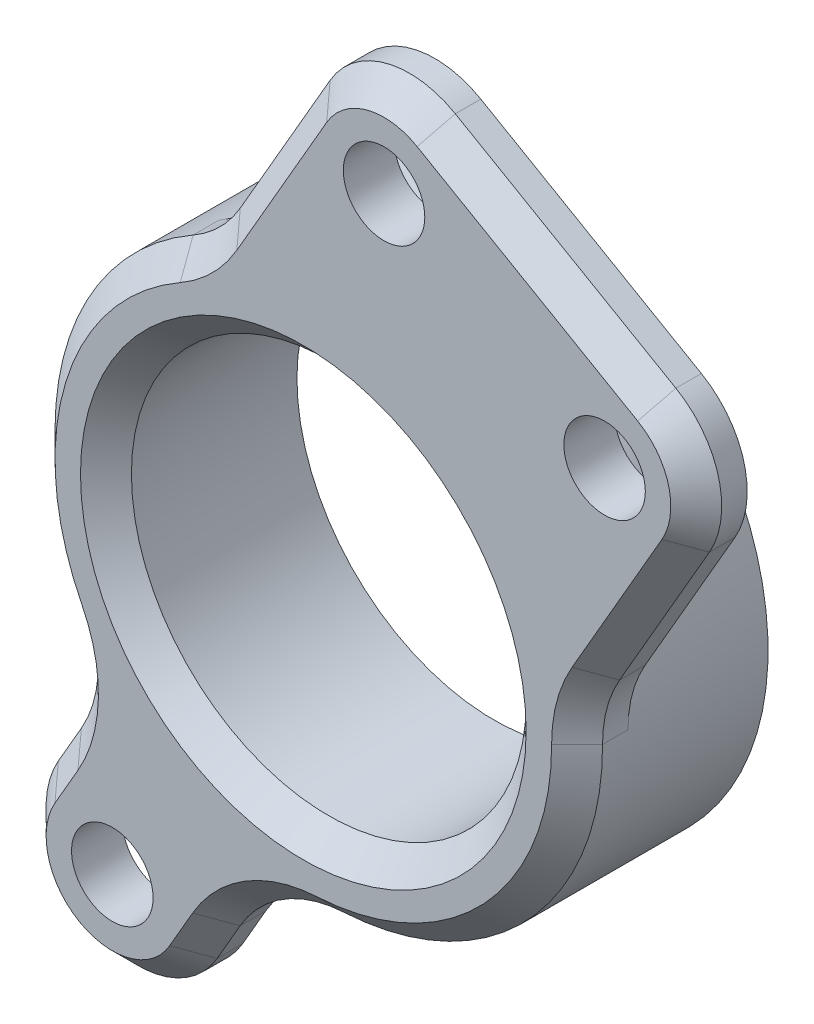
ISO-10303-21;
HEADER;
FILE_DESCRIPTION(('STEP AP214'),'2;1');
FILE_NAME('part.step','',(''),(''),'','','');
FILE_SCHEMA(('AUTOMOTIVE_DESIGN { 1 0 10303 214 1 1 1 1 }'));
ENDSEC;
DATA;
#1=APPLICATION_CONTEXT('core data for automotive mechanical design processes');
#2=APPLICATION_PROTOCOL_DEFINITION('international standard','automotive_design',2000,#1);
#3=PRODUCT_CONTEXT('',#1,'mechanical');
#4=PRODUCT('Part','Part','',(#3));
#5=PRODUCT_RELATED_PRODUCT_CATEGORY('part','',(#4));
#6=PRODUCT_DEFINITION_FORMATION('','',#4);
#7=PRODUCT_DEFINITION_CONTEXT('part definition',#1,'design');
#8=PRODUCT_DEFINITION('design','',#6,#7);
#9=PRODUCT_DEFINITION_SHAPE('','',#8);
#10=(LENGTH_UNIT() NAMED_UNIT(*) SI_UNIT(.MILLI.,.METRE.));
#11=(NAMED_UNIT(*) PLANE_ANGLE_UNIT() SI_UNIT($,.RADIAN.));
#12=(NAMED_UNIT(*) SI_UNIT($,.STERADIAN.) SOLID_ANGLE_UNIT());
#13=UNCERTAINTY_MEASURE_WITH_UNIT(LENGTH_MEASURE(1.E-05),#10,'distance_accuracy_value','');
#14=(GEOMETRIC_REPRESENTATION_CONTEXT(3) GLOBAL_UNCERTAINTY_ASSIGNED_CONTEXT((#13)) GLOBAL_UNIT_ASSIGNED_CONTEXT((#10,
#11,#12)) REPRESENTATION_CONTEXT('',''));
#15=CARTESIAN_POINT('',(0.,0.,0.));
#16=DIRECTION('',(0.,0.,1.));
#17=DIRECTION('',(1.,0.,0.));
#18=AXIS2_PLACEMENT_3D('',#15,#16,#17);
#19=CARTESIAN_POINT('',(0.,0.,0.));
#20=DIRECTION('',(0.,0.,1.));
#21=DIRECTION('',(1.,0.,0.));
#22=AXIS2_PLACEMENT_3D('',#19,#20,#21);
#23=PLANE('',#22);
#24=CARTESIAN_POINT('',(3.16987298107781,15.4903810567665,0.));
#25=DIRECTION('',(0.,0.,1.));
#26=DIRECTION('',(1.,0.,0.));
#27=AXIS2_PLACEMENT_3D('',#24,#25,#26);
#28=CIRCLE('',#27,1.6);
#29=CARTESIAN_POINT('',(4.76987298107781,15.4903810567665,0.));
#30=VERTEX_POINT('',#29);
#31=EDGE_CURVE('E245',#30,#30,#28,.T.);
#32=ORIENTED_EDGE('',*,*,#31,.T.);
#33=EDGE_LOOP('',(#32));
#34=FACE_BOUND('',#33,.T.);
#35=CARTESIAN_POINT('',(11.8301270189222,10.4903810567665,0.));
#36=DIRECTION('',(0.,0.,1.));
#37=DIRECTION('',(1.,0.,0.));
#38=AXIS2_PLACEMENT_3D('',#35,#36,#37);
#39=CIRCLE('',#38,1.6);
#40=CARTESIAN_POINT('',(13.4301270189222,10.4903810567665,0.));
#41=VERTEX_POINT('',#40);
#42=EDGE_CURVE('E242',#41,#41,#39,.T.);
#43=ORIENTED_EDGE('',*,*,#42,.T.);
#44=EDGE_LOOP('',(#43));
#45=FACE_BOUND('',#44,.T.);
#46=DIRECTION('',(-0.500000000000001,-0.866025403784438,0.));
#47=VECTOR('',#46,1.);
#48=CARTESIAN_POINT('',(7.44781847254616,-4.3,0.));
#49=LINE('',#48,#47);
#50=CARTESIAN_POINT('',(14.9478184725461,8.69038105676655,0.));
#51=VERTEX_POINT('',#50);
#52=CARTESIAN_POINT('',(11.4196725735927,2.57945310326333,0.));
#53=VERTEX_POINT('',#52);
#54=EDGE_CURVE('E227',#51,#53,#49,.T.);
#55=ORIENTED_EDGE('',*,*,#54,.T.);
#56=CARTESIAN_POINT('',(15.7497995925148,0.0794531032633251,0.));
#57=DIRECTION('',(0.,0.,1.));
#58=DIRECTION('',(1.,0.,0.));
#59=AXIS2_PLACEMENT_3D('',#56,#57,#58);
#60=CIRCLE('',#59,5.);
#61=CARTESIAN_POINT('',(10.7498632139387,0.0542298958781293,0.));
#62=VERTEX_POINT('',#61);
#63=EDGE_CURVE('E284',#53,#62,#60,.T.);
#64=ORIENTED_EDGE('',*,*,#63,.T.);
#65=CARTESIAN_POINT('',(0.,0.,0.));
#66=DIRECTION('',(0.,0.,1.));
#67=DIRECTION('',(1.,0.,0.));
#68=AXIS2_PLACEMENT_3D('',#65,#66,#67);
#69=CIRCLE('',#68,10.75);
#70=CARTESIAN_POINT('',(-5.3279671394943,9.33676957841782,0.));
#71=VERTEX_POINT('',#70);
#72=EDGE_CURVE('E390',#62,#71,#69,.T.);
#73=ORIENTED_EDGE('',*,*,#72,.T.);
#74=CARTESIAN_POINT('',(-7.80609139042187,13.6794531032633,0.));
#75=DIRECTION('',(0.,0.,1.));
#76=DIRECTION('',(1.,0.,0.));
#77=AXIS2_PLACEMENT_3D('',#74,#75,#76);
#78=CIRCLE('',#77,5.);
#79=CARTESIAN_POINT('',(-3.47596437149967,11.1794531032633,0.));
#80=VERTEX_POINT('',#79);
#81=EDGE_CURVE('E278',#71,#80,#78,.T.);
#82=ORIENTED_EDGE('',*,*,#81,.T.);
#83=DIRECTION('',(-0.500000000000001,-0.866025403784438,0.));
#84=VECTOR('',#83,1.);
#85=CARTESIAN_POINT('',(-7.44781847254617,4.3,0.));
#86=LINE('',#85,#84);
#87=CARTESIAN_POINT('',(0.0521815274538246,17.2903810567665,0.));
#88=VERTEX_POINT('',#87);
#89=EDGE_CURVE('E239',#88,#80,#86,.T.);
#90=ORIENTED_EDGE('',*,*,#89,.F.);
#91=CARTESIAN_POINT('',(3.16987298107781,15.4903810567665,0.));
#92=DIRECTION('',(0.,0.,1.));
#93=DIRECTION('',(1.,0.,0.));
#94=AXIS2_PLACEMENT_3D('',#91,#92,#93);
#95=CIRCLE('',#94,3.6);
#96=CARTESIAN_POINT('',(4.96987298107781,18.6080725103905,0.));
#97=VERTEX_POINT('',#96);
#98=EDGE_CURVE('E236',#97,#88,#95,.T.);
#99=ORIENTED_EDGE('',*,*,#98,.F.);
#100=DIRECTION('',(0.866025403784438,-0.500000000000001,0.));
#101=VECTOR('',#100,1.);
#102=CARTESIAN_POINT('',(9.29999999999999,16.1080725103905,0.));
#103=LINE('',#102,#101);
#104=CARTESIAN_POINT('',(13.6301270189222,13.6080725103905,0.));
#105=VERTEX_POINT('',#104);
#106=EDGE_CURVE('E233',#97,#105,#103,.T.);
#107=ORIENTED_EDGE('',*,*,#106,.T.);
#108=CARTESIAN_POINT('',(11.8301270189222,10.4903810567665,0.));
#109=DIRECTION('',(0.,0.,1.));
#110=DIRECTION('',(1.,0.,0.));
#111=AXIS2_PLACEMENT_3D('',#108,#109,#110);
#112=CIRCLE('',#111,3.6);
#113=EDGE_CURVE('E230',#105,#51,#112,.F.);
#114=ORIENTED_EDGE('',*,*,#113,.T.);
#115=EDGE_LOOP('',(#55,#64,#73,#82,#90,#99,#107,#114));
#116=FACE_BOUND('',#115,.T.);
#117=ADVANCED_FACE('F48',(#34,#45,#116),#23,.F.);
#118=CARTESIAN_POINT('',(-3.11769145362399,1.80000000000001,2.));
#119=DIRECTION('',(-0.866025403784439,0.5,0.));
#120=DIRECTION('',(-0.5,-0.866025403784439,0.));
#121=AXIS2_PLACEMENT_3D('',#118,#119,#120);
#122=PLANE('',#121);
#123=DIRECTION('',(0.,0.,-1.));
#124=VECTOR('',#123,1.);
#125=CARTESIAN_POINT('',(-10.617691453624,-11.1903810567666,2.));
#126=LINE('',#125,#124);
#127=CARTESIAN_POINT('',(-10.617691453624,-11.1903810567666,0.999999999999991));
#128=VERTEX_POINT('',#127);
#129=CARTESIAN_POINT('',(-10.617691453624,-11.1903810567666,0.));
#130=VERTEX_POINT('',#129);
#131=EDGE_CURVE('E194',#128,#130,#126,.T.);
#132=ORIENTED_EDGE('',*,*,#131,.F.);
#133=DIRECTION('',(0.5,0.866025403784439,0.));
#134=VECTOR('',#133,1.);
#135=CARTESIAN_POINT('',(-3.11769145362399,1.80000000000001,0.999999999999991));
#136=LINE('',#135,#134);
#137=CARTESIAN_POINT('',(-9.71508677299059,-9.62702389076004,0.999999999999992));
#138=VERTEX_POINT('',#137);
#139=EDGE_CURVE('E323',#128,#138,#136,.T.);
#140=ORIENTED_EDGE('',*,*,#139,.T.);
#141=DIRECTION('',(0.,0.,-1.));
#142=VECTOR('',#141,1.);
#143=CARTESIAN_POINT('',(-9.71508677299059,-9.62702389076004,2.));
#144=LINE('',#143,#142);
#145=CARTESIAN_POINT('',(-9.71508677299059,-9.62702389076004,0.));
#146=VERTEX_POINT('',#145);
#147=EDGE_CURVE('E217',#138,#146,#144,.T.);
#148=ORIENTED_EDGE('',*,*,#147,.T.);
#149=DIRECTION('',(0.5,0.866025403784439,0.));
#150=VECTOR('',#149,1.);
#151=CARTESIAN_POINT('',(-3.11769145362399,1.80000000000001,0.));
#152=LINE('',#151,#150);
#153=EDGE_CURVE('E211',#130,#146,#152,.T.);
#154=ORIENTED_EDGE('',*,*,#153,.F.);
#155=EDGE_LOOP('',(#132,#140,#148,#154));
#156=FACE_BOUND('',#155,.T.);
#157=ADVANCED_FACE('F215',(#156),#122,.T.);
#158=CARTESIAN_POINT('',(-7.50000000000003,-12.9903810567666,2.));
#159=DIRECTION('',(0.,0.,-1.));
#160=DIRECTION('',(-1.,0.,0.));
#161=AXIS2_PLACEMENT_3D('',#158,#159,#160);
#162=CYLINDRICAL_SURFACE('',#161,3.6);
#163=DIRECTION('',(0.,0.,-1.));
#164=VECTOR('',#163,1.);
#165=CARTESIAN_POINT('',(-4.38230854637605,-14.7903810567666,2.));
#166=LINE('',#165,#164);
#167=CARTESIAN_POINT('',(-4.38230854637605,-14.7903810567666,0.999999999999992));
#168=VERTEX_POINT('',#167);
#169=CARTESIAN_POINT('',(-4.38230854637605,-14.7903810567666,0.));
#170=VERTEX_POINT('',#169);
#171=EDGE_CURVE('E204',#168,#170,#166,.T.);
#172=ORIENTED_EDGE('',*,*,#171,.F.);
#173=CARTESIAN_POINT('',(-7.50000000000003,-12.9903810567666,0.999999999999992));
#174=DIRECTION('',(0.,0.,1.));
#175=DIRECTION('',(1.,0.,0.));
#176=AXIS2_PLACEMENT_3D('',#173,#174,#175);
#177=CIRCLE('',#176,3.6);
#178=EDGE_CURVE('E200',#168,#128,#177,.F.);
#179=ORIENTED_EDGE('',*,*,#178,.T.);
#180=ORIENTED_EDGE('',*,*,#131,.T.);
#181=CARTESIAN_POINT('',(-7.50000000000003,-12.9903810567666,0.));
#182=DIRECTION('',(0.,0.,1.));
#183=DIRECTION('',(1.,0.,0.));
#184=AXIS2_PLACEMENT_3D('',#181,#182,#183);
#185=CIRCLE('',#184,3.6);
#186=EDGE_CURVE('E198',#130,#170,#185,.T.);
#187=ORIENTED_EDGE('',*,*,#186,.T.);
#188=EDGE_LOOP('',(#172,#179,#180,#187));
#189=FACE_BOUND('',#188,.T.);
#190=ADVANCED_FACE('F197',(#189),#162,.T.);
#191=CARTESIAN_POINT('',(3.11769145362398,-1.8,2.));
#192=DIRECTION('',(-0.866025403784438,0.5,0.));
#193=DIRECTION('',(-0.5,-0.866025403784438,0.));
#194=AXIS2_PLACEMENT_3D('',#191,#192,#193);
#195=PLANE('',#194);
#196=DIRECTION('',(0.,0.,1.));
#197=VECTOR('',#196,1.);
#198=CARTESIAN_POINT('',(-3.47970386574262,-13.22702389076,2.));
#199=LINE('',#198,#197);
#200=CARTESIAN_POINT('',(-3.47970386574262,-13.22702389076,0.));
#201=VERTEX_POINT('',#200);
#202=CARTESIAN_POINT('',(-3.47970386574262,-13.22702389076,0.999999999999992));
#203=VERTEX_POINT('',#202);
#204=EDGE_CURVE('E273',#201,#203,#199,.T.);
#205=ORIENTED_EDGE('',*,*,#204,.T.);
#206=DIRECTION('',(-0.5,-0.866025403784438,0.));
#207=VECTOR('',#206,1.);
#208=CARTESIAN_POINT('',(-4.38230854637605,-14.7903810567666,0.999999999999992));
#209=LINE('',#208,#207);
#210=EDGE_CURVE('E325',#203,#168,#209,.T.);
#211=ORIENTED_EDGE('',*,*,#210,.T.);
#212=ORIENTED_EDGE('',*,*,#171,.T.);
#213=DIRECTION('',(0.5,0.866025403784438,0.));
#214=VECTOR('',#213,1.);
#215=CARTESIAN_POINT('',(3.11769145362398,-1.8,0.));
#216=LINE('',#215,#214);
#217=EDGE_CURVE('E213',#170,#201,#216,.T.);
#218=ORIENTED_EDGE('',*,*,#217,.T.);
#219=EDGE_LOOP('',(#205,#211,#212,#218));
#220=FACE_BOUND('',#219,.T.);
#221=ADVANCED_FACE('F462',(#220),#195,.F.);
#222=CARTESIAN_POINT('',(7.44781847254616,-4.3,2.));
#223=DIRECTION('',(0.866025403784438,-0.500000000000001,0.));
#224=DIRECTION('',(0.500000000000001,0.866025403784438,0.));
#225=AXIS2_PLACEMENT_3D('',#222,#223,#224);
#226=PLANE('',#225);
#227=DIRECTION('',(0.,0.,-1.));
#228=VECTOR('',#227,1.);
#229=CARTESIAN_POINT('',(14.9478184725461,8.69038105676655,2.));
#230=LINE('',#229,#228);
#231=CARTESIAN_POINT('',(14.9478184725461,8.69038105676655,0.999999999999992));
#232=VERTEX_POINT('',#231);
#233=EDGE_CURVE('E256',#232,#51,#230,.T.);
#234=ORIENTED_EDGE('',*,*,#233,.F.);
#235=DIRECTION('',(-0.500000000000001,-0.866025403784438,0.));
#236=VECTOR('',#235,1.);
#237=CARTESIAN_POINT('',(7.44781847254616,-4.3,0.999999999999991));
#238=LINE('',#237,#236);
#239=CARTESIAN_POINT('',(11.4196725735927,2.57945310326333,0.999999999999991));
#240=VERTEX_POINT('',#239);
#241=EDGE_CURVE('E341',#232,#240,#238,.T.);
#242=ORIENTED_EDGE('',*,*,#241,.T.);
#243=DIRECTION('',(0.,0.,-1.));
#244=VECTOR('',#243,1.);
#245=CARTESIAN_POINT('',(11.4196725735927,2.57945310326333,2.));
#246=LINE('',#245,#244);
#247=EDGE_CURVE('E276',#240,#53,#246,.T.);
#248=ORIENTED_EDGE('',*,*,#247,.T.);
#249=ORIENTED_EDGE('',*,*,#54,.F.);
#250=EDGE_LOOP('',(#234,#242,#248,#249));
#251=FACE_BOUND('',#250,.T.);
#252=ADVANCED_FACE('F458',(#251),#226,.T.);
#253=CARTESIAN_POINT('',(11.8301270189222,10.4903810567665,2.));
#254=DIRECTION('',(0.,0.,-1.));
#255=DIRECTION('',(-1.,0.,0.));
#256=AXIS2_PLACEMENT_3D('',#253,#254,#255);
#257=CYLINDRICAL_SURFACE('',#256,3.6);
#258=DIRECTION('',(0.,0.,-1.));
#259=VECTOR('',#258,1.);
#260=CARTESIAN_POINT('',(13.6301270189222,13.6080725103905,2.));
#261=LINE('',#260,#259);
#262=CARTESIAN_POINT('',(13.6301270189222,13.6080725103905,0.999999999999992));
#263=VERTEX_POINT('',#262);
#264=EDGE_CURVE('E254',#263,#105,#261,.T.);
#265=ORIENTED_EDGE('',*,*,#264,.F.);
#266=CARTESIAN_POINT('',(11.8301270189222,10.4903810567665,0.999999999999992));
#267=DIRECTION('',(0.,0.,1.));
#268=DIRECTION('',(1.,0.,0.));
#269=AXIS2_PLACEMENT_3D('',#266,#267,#268);
#270=CIRCLE('',#269,3.6);
#271=EDGE_CURVE('E58',#263,#232,#270,.F.);
#272=ORIENTED_EDGE('',*,*,#271,.T.);
#273=ORIENTED_EDGE('',*,*,#233,.T.);
#274=ORIENTED_EDGE('',*,*,#113,.F.);
#275=EDGE_LOOP('',(#265,#272,#273,#274));
#276=FACE_BOUND('',#275,.T.);
#277=ADVANCED_FACE('F455',(#276),#257,.T.);
#278=CARTESIAN_POINT('',(9.29999999999999,16.1080725103905,2.));
#279=DIRECTION('',(0.500000000000001,0.866025403784438,0.));
#280=DIRECTION('',(-0.866025403784438,0.500000000000001,0.));
#281=AXIS2_PLACEMENT_3D('',#278,#279,#280);
#282=PLANE('',#281);
#283=DIRECTION('',(0.,0.,-1.));
#284=VECTOR('',#283,1.);
#285=CARTESIAN_POINT('',(4.96987298107781,18.6080725103905,2.));
#286=LINE('',#285,#284);
#287=CARTESIAN_POINT('',(4.96987298107781,18.6080725103905,0.999999999999992));
#288=VERTEX_POINT('',#287);
#289=EDGE_CURVE('E251',#288,#97,#286,.T.);
#290=ORIENTED_EDGE('',*,*,#289,.F.);
#291=DIRECTION('',(0.866025403784438,-0.500000000000001,0.));
#292=VECTOR('',#291,1.);
#293=CARTESIAN_POINT('',(9.29999999999999,16.1080725103905,0.999999999999992));
#294=LINE('',#293,#292);
#295=EDGE_CURVE('E12',#288,#263,#294,.T.);
#296=ORIENTED_EDGE('',*,*,#295,.T.);
#297=ORIENTED_EDGE('',*,*,#264,.T.);
#298=ORIENTED_EDGE('',*,*,#106,.F.);
#299=EDGE_LOOP('',(#290,#296,#297,#298));
#300=FACE_BOUND('',#299,.T.);
#301=ADVANCED_FACE('F452',(#300),#282,.T.);
#302=CARTESIAN_POINT('',(3.16987298107781,15.4903810567665,2.));
#303=DIRECTION('',(0.,0.,-1.));
#304=DIRECTION('',(-1.,0.,0.));
#305=AXIS2_PLACEMENT_3D('',#302,#303,#304);
#306=CYLINDRICAL_SURFACE('',#305,3.6);
#307=DIRECTION('',(0.,0.,-1.));
#308=VECTOR('',#307,1.);
#309=CARTESIAN_POINT('',(0.0521815274538246,17.2903810567665,2.));
#310=LINE('',#309,#308);
#311=CARTESIAN_POINT('',(0.0521815274538246,17.2903810567665,0.999999999999992));
#312=VERTEX_POINT('',#311);
#313=EDGE_CURVE('E249',#312,#88,#310,.T.);
#314=ORIENTED_EDGE('',*,*,#313,.F.);
#315=CARTESIAN_POINT('',(3.16987298107781,15.4903810567665,0.999999999999992));
#316=DIRECTION('',(0.,0.,1.));
#317=DIRECTION('',(1.,0.,0.));
#318=AXIS2_PLACEMENT_3D('',#315,#316,#317);
#319=CIRCLE('',#318,3.6);
#320=EDGE_CURVE('E72',#312,#288,#319,.F.);
#321=ORIENTED_EDGE('',*,*,#320,.T.);
#322=ORIENTED_EDGE('',*,*,#289,.T.);
#323=ORIENTED_EDGE('',*,*,#98,.T.);
#324=EDGE_LOOP('',(#314,#321,#322,#323));
#325=FACE_BOUND('',#324,.T.);
#326=ADVANCED_FACE('F448',(#325),#306,.T.);
#327=CARTESIAN_POINT('',(-7.44781847254617,4.3,2.));
#328=DIRECTION('',(0.866025403784438,-0.500000000000001,0.));
#329=DIRECTION('',(0.500000000000001,0.866025403784438,0.));
#330=AXIS2_PLACEMENT_3D('',#327,#328,#329);
#331=PLANE('',#330);
#332=DIRECTION('',(0.,0.,1.));
#333=VECTOR('',#332,1.);
#334=CARTESIAN_POINT('',(-3.47596437149967,11.1794531032633,2.));
#335=LINE('',#334,#333);
#336=CARTESIAN_POINT('',(-3.47596437149967,11.1794531032633,0.999999999999994));
#337=VERTEX_POINT('',#336);
#338=EDGE_CURVE('E269',#80,#337,#335,.T.);
#339=ORIENTED_EDGE('',*,*,#338,.T.);
#340=DIRECTION('',(0.500000000000001,0.866025403784438,0.));
#341=VECTOR('',#340,1.);
#342=CARTESIAN_POINT('',(0.0521815274538241,17.2903810567665,0.999999999999994));
#343=LINE('',#342,#341);
#344=EDGE_CURVE('E339',#337,#312,#343,.T.);
#345=ORIENTED_EDGE('',*,*,#344,.T.);
#346=ORIENTED_EDGE('',*,*,#313,.T.);
#347=ORIENTED_EDGE('',*,*,#89,.T.);
#348=EDGE_LOOP('',(#339,#345,#346,#347));
#349=FACE_BOUND('',#348,.T.);
#350=ADVANCED_FACE('F438',(#349),#331,.F.);
#351=CARTESIAN_POINT('',(11.8301270189222,10.4903810567665,2.));
#352=DIRECTION('',(0.,0.,-1.));
#353=DIRECTION('',(-1.,0.,0.));
#354=AXIS2_PLACEMENT_3D('',#351,#352,#353);
#355=CYLINDRICAL_SURFACE('',#354,1.6);
#356=CARTESIAN_POINT('',(11.8301270189222,10.4903810567665,2.));
#357=DIRECTION('',(0.,0.,1.));
#358=DIRECTION('',(1.,0.,0.));
#359=AXIS2_PLACEMENT_3D('',#356,#357,#358);
#360=CIRCLE('',#359,1.6);
#361=CARTESIAN_POINT('',(13.4301270189222,10.4903810567665,2.));
#362=VERTEX_POINT('',#361);
#363=EDGE_CURVE('E400',#362,#362,#360,.T.);
#364=ORIENTED_EDGE('',*,*,#363,.T.);
#365=EDGE_LOOP('',(#364));
#366=FACE_BOUND('',#365,.T.);
#367=ORIENTED_EDGE('',*,*,#42,.F.);
#368=EDGE_LOOP('',(#367));
#369=FACE_BOUND('',#368,.T.);
#370=ADVANCED_FACE('F434',(#366,#369),#355,.F.);
#371=CARTESIAN_POINT('',(0.,0.,2.));
#372=DIRECTION('',(0.,0.,-1.));
#373=DIRECTION('',(-1.,0.,0.));
#374=AXIS2_PLACEMENT_3D('',#371,#372,#373);
#375=CYLINDRICAL_SURFACE('',#374,7.75);
#376=CARTESIAN_POINT('',(0.,0.,0.999999999999988));
#377=DIRECTION('',(0.,0.,1.));
#378=DIRECTION('',(1.,0.,0.));
#379=AXIS2_PLACEMENT_3D('',#376,#377,#378);
#380=CIRCLE('',#379,7.75);
#381=CARTESIAN_POINT('',(7.74999999999997,0.,0.999999999999988));
#382=VERTEX_POINT('',#381);
#383=EDGE_CURVE('E287',#382,#382,#380,.T.);
#384=ORIENTED_EDGE('',*,*,#383,.T.);
#385=EDGE_LOOP('',(#384));
#386=FACE_BOUND('',#385,.T.);
#387=CARTESIAN_POINT('',(0.,0.,-5.50000000000001));
#388=DIRECTION('',(0.,0.,-1.));
#389=DIRECTION('',(-1.,0.,0.));
#390=AXIS2_PLACEMENT_3D('',#387,#388,#389);
#391=CIRCLE('',#390,7.75);
#392=CARTESIAN_POINT('',(-7.75000000000002,0.,-5.5));
#393=VERTEX_POINT('',#392);
#394=EDGE_CURVE('E222',#393,#393,#391,.F.);
#395=ORIENTED_EDGE('',*,*,#394,.F.);
#396=EDGE_LOOP('',(#395));
#397=FACE_BOUND('',#396,.T.);
#398=ADVANCED_FACE('F437',(#386,#397),#375,.F.);
#399=CARTESIAN_POINT('',(0.,0.,2.));
#400=DIRECTION('',(0.,0.,-1.));
#401=DIRECTION('',(-1.,0.,0.));
#402=AXIS2_PLACEMENT_3D('',#399,#400,#401);
#403=CYLINDRICAL_SURFACE('',#402,10.75);
#404=DIRECTION('',(0.,0.,-1.));
#405=VECTOR('',#404,1.);
#406=CARTESIAN_POINT('',(-9.58641576273413,-4.8644766238521,2.));
#407=LINE('',#406,#405);
#408=CARTESIAN_POINT('',(-9.58641576273413,-4.8644766238521,0.));
#409=VERTEX_POINT('',#408);
#410=CARTESIAN_POINT('',(-9.58641576273413,-4.8644766238521,0.999999999999992));
#411=VERTEX_POINT('',#410);
#412=EDGE_CURVE('E264',#409,#411,#407,.F.);
#413=ORIENTED_EDGE('',*,*,#412,.T.);
#414=CARTESIAN_POINT('',(0.,0.,0.999999999999992));
#415=DIRECTION('',(0.,0.,1.));
#416=DIRECTION('',(1.,0.,0.));
#417=AXIS2_PLACEMENT_3D('',#414,#415,#416);
#418=CIRCLE('',#417,10.75);
#419=CARTESIAN_POINT('',(-5.3279671394943,9.33676957841782,0.999999999999992));
#420=VERTEX_POINT('',#419);
#421=EDGE_CURVE('E333',#411,#420,#418,.F.);
#422=ORIENTED_EDGE('',*,*,#421,.T.);
#423=DIRECTION('',(0.,0.,-1.));
#424=VECTOR('',#423,1.);
#425=CARTESIAN_POINT('',(-5.3279671394943,9.33676957841782,2.));
#426=LINE('',#425,#424);
#427=EDGE_CURVE('E267',#420,#71,#426,.T.);
#428=ORIENTED_EDGE('',*,*,#427,.T.);
#429=ORIENTED_EDGE('',*,*,#72,.F.);
#430=DIRECTION('',(0.,0.,-1.));
#431=VECTOR('',#430,1.);
#432=CARTESIAN_POINT('',(10.7498632139387,0.0542298958781293,2.));
#433=LINE('',#432,#431);
#434=CARTESIAN_POINT('',(10.7498632139387,0.0542298958781293,0.999999999999992));
#435=VERTEX_POINT('',#434);
#436=EDGE_CURVE('E259',#62,#435,#433,.F.);
#437=ORIENTED_EDGE('',*,*,#436,.T.);
#438=CARTESIAN_POINT('',(0.,0.,0.999999999999992));
#439=DIRECTION('',(0.,0.,1.));
#440=DIRECTION('',(1.,0.,0.));
#441=AXIS2_PLACEMENT_3D('',#438,#439,#440);
#442=CIRCLE('',#441,10.75);
#443=CARTESIAN_POINT('',(0.580447548995569,-10.7343178936934,0.999999999999992));
#444=VERTEX_POINT('',#443);
#445=EDGE_CURVE('E331',#435,#444,#442,.F.);
#446=ORIENTED_EDGE('',*,*,#445,.T.);
#447=DIRECTION('',(0.,0.,-1.));
#448=VECTOR('',#447,1.);
#449=CARTESIAN_POINT('',(0.580447548995569,-10.7343178936934,2.));
#450=LINE('',#449,#448);
#451=CARTESIAN_POINT('',(0.580447548995569,-10.7343178936934,0.));
#452=VERTEX_POINT('',#451);
#453=EDGE_CURVE('E262',#444,#452,#450,.T.);
#454=ORIENTED_EDGE('',*,*,#453,.T.);
#455=EDGE_CURVE('E203',#409,#452,#69,.T.);
#456=ORIENTED_EDGE('',*,*,#455,.F.);
#457=EDGE_LOOP('',(#413,#422,#428,#429,#437,#446,#454,#456));
#458=FACE_BOUND('',#457,.T.);
#459=CARTESIAN_POINT('',(0.,0.,-5.50000000000001));
#460=DIRECTION('',(0.,0.,-1.));
#461=DIRECTION('',(-1.,0.,0.));
#462=AXIS2_PLACEMENT_3D('',#459,#460,#461);
#463=CIRCLE('',#462,10.75);
#464=CARTESIAN_POINT('',(-10.75,0.,-5.5));
#465=VERTEX_POINT('',#464);
#466=EDGE_CURVE('E385',#465,#465,#463,.F.);
#467=ORIENTED_EDGE('',*,*,#466,.T.);
#468=EDGE_LOOP('',(#467));
#469=FACE_BOUND('',#468,.T.);
#470=ADVANCED_FACE('F442',(#458,#469),#403,.T.);
#471=CARTESIAN_POINT('',(-7.50000000000003,-12.9903810567666,2.));
#472=DIRECTION('',(0.,0.,-1.));
#473=DIRECTION('',(-1.,0.,0.));
#474=AXIS2_PLACEMENT_3D('',#471,#472,#473);
#475=CYLINDRICAL_SURFACE('',#474,1.6);
#476=CARTESIAN_POINT('',(-7.50000000000003,-12.9903810567666,2.));
#477=DIRECTION('',(0.,0.,1.));
#478=DIRECTION('',(1.,0.,0.));
#479=AXIS2_PLACEMENT_3D('',#476,#477,#478);
#480=CIRCLE('',#479,1.6);
#481=CARTESIAN_POINT('',(-5.90000000000003,-12.9903810567666,2.));
#482=VERTEX_POINT('',#481);
#483=EDGE_CURVE('E248',#482,#482,#480,.T.);
#484=ORIENTED_EDGE('',*,*,#483,.T.);
#485=EDGE_LOOP('',(#484));
#486=FACE_BOUND('',#485,.T.);
#487=CARTESIAN_POINT('',(-7.50000000000003,-12.9903810567666,0.));
#488=DIRECTION('',(0.,0.,1.));
#489=DIRECTION('',(1.,0.,0.));
#490=AXIS2_PLACEMENT_3D('',#487,#488,#489);
#491=CIRCLE('',#490,1.6);
#492=CARTESIAN_POINT('',(-5.90000000000003,-12.9903810567666,0.));
#493=VERTEX_POINT('',#492);
#494=EDGE_CURVE('E219',#493,#493,#491,.T.);
#495=ORIENTED_EDGE('',*,*,#494,.F.);
#496=EDGE_LOOP('',(#495));
#497=FACE_BOUND('',#496,.T.);
#498=ADVANCED_FACE('F421',(#486,#497),#475,.F.);
#499=CARTESIAN_POINT('',(3.16987298107781,15.4903810567665,2.));
#500=DIRECTION('',(0.,0.,-1.));
#501=DIRECTION('',(-1.,0.,0.));
#502=AXIS2_PLACEMENT_3D('',#499,#500,#501);
#503=CYLINDRICAL_SURFACE('',#502,1.6);
#504=CARTESIAN_POINT('',(3.16987298107781,15.4903810567665,2.));
#505=DIRECTION('',(0.,0.,1.));
#506=DIRECTION('',(1.,0.,0.));
#507=AXIS2_PLACEMENT_3D('',#504,#505,#506);
#508=CIRCLE('',#507,1.6);
#509=CARTESIAN_POINT('',(4.76987298107781,15.4903810567665,2.));
#510=VERTEX_POINT('',#509);
#511=EDGE_CURVE('E252',#510,#510,#508,.T.);
#512=ORIENTED_EDGE('',*,*,#511,.T.);
#513=EDGE_LOOP('',(#512));
#514=FACE_BOUND('',#513,.T.);
#515=ORIENTED_EDGE('',*,*,#31,.F.);
#516=EDGE_LOOP('',(#515));
#517=FACE_BOUND('',#516,.T.);
#518=ADVANCED_FACE('F405',(#514,#517),#503,.F.);
#519=CARTESIAN_POINT('',(0.,0.,2.));
#520=DIRECTION('',(0.,0.,1.));
#521=DIRECTION('',(1.,0.,0.));
#522=AXIS2_PLACEMENT_3D('',#519,#520,#521);
#523=PLANE('',#522);
#524=CARTESIAN_POINT('',(0.,0.,2.));
#525=DIRECTION('',(0.,0.,1.));
#526=DIRECTION('',(1.,0.,0.));
#527=AXIS2_PLACEMENT_3D('',#524,#525,#526);
#528=CIRCLE('',#527,8.75000000000001);
#529=CARTESIAN_POINT('',(8.74999999999998,0.,2.));
#530=VERTEX_POINT('',#529);
#531=EDGE_CURVE('E319',#530,#530,#528,.F.);
#532=ORIENTED_EDGE('',*,*,#531,.T.);
#533=EDGE_LOOP('',(#532));
#534=FACE_BOUND('',#533,.T.);
#535=DIRECTION('',(-0.5,-0.866025403784439,0.));
#536=VECTOR('',#535,1.);
#537=CARTESIAN_POINT('',(-2.25166604983954,1.3,2.));
#538=LINE('',#537,#536);
#539=CARTESIAN_POINT('',(-8.84906136920614,-10.12702389076,2.));
#540=VERTEX_POINT('',#539);
#541=CARTESIAN_POINT('',(-9.75166604983957,-11.6903810567666,2.));
#542=VERTEX_POINT('',#541);
#543=EDGE_CURVE('E314',#540,#542,#538,.T.);
#544=ORIENTED_EDGE('',*,*,#543,.T.);
#545=CARTESIAN_POINT('',(-7.50000000000003,-12.9903810567666,2.));
#546=DIRECTION('',(0.,0.,1.));
#547=DIRECTION('',(1.,0.,0.));
#548=AXIS2_PLACEMENT_3D('',#545,#546,#547);
#549=CIRCLE('',#548,2.59999999999999);
#550=CARTESIAN_POINT('',(-5.2483339501605,-14.2903810567666,2.));
#551=VERTEX_POINT('',#550);
#552=EDGE_CURVE('E316',#542,#551,#549,.T.);
#553=ORIENTED_EDGE('',*,*,#552,.T.);
#554=DIRECTION('',(0.5,0.866025403784438,0.));
#555=VECTOR('',#554,1.);
#556=CARTESIAN_POINT('',(-4.34572926952707,-12.72702389076,2.));
#557=LINE('',#556,#555);
#558=CARTESIAN_POINT('',(-4.34572926952707,-12.72702389076,2.));
#559=VERTEX_POINT('',#558);
#560=EDGE_CURVE('E312',#551,#559,#557,.T.);
#561=ORIENTED_EDGE('',*,*,#560,.T.);
#562=CARTESIAN_POINT('',(0.850423153179568,-15.72702389076,2.));
#563=DIRECTION('',(0.,0.,1.));
#564=DIRECTION('',(1.,0.,0.));
#565=AXIS2_PLACEMENT_3D('',#562,#563,#564);
#566=CIRCLE('',#565,6.00000000000001);
#567=CARTESIAN_POINT('',(0.526452428158769,-9.73577669428003,2.));
#568=VERTEX_POINT('',#567);
#569=EDGE_CURVE('E308',#559,#568,#566,.F.);
#570=ORIENTED_EDGE('',*,*,#569,.T.);
#571=CARTESIAN_POINT('',(0.,0.,2.));
#572=DIRECTION('',(0.,0.,1.));
#573=DIRECTION('',(1.,0.,0.));
#574=AXIS2_PLACEMENT_3D('',#571,#572,#573);
#575=CIRCLE('',#574,9.74999999999998);
#576=CARTESIAN_POINT('',(9.74987593822345,0.0491852544010901,2.));
#577=VERTEX_POINT('',#576);
#578=EDGE_CURVE('E304',#568,#577,#575,.T.);
#579=ORIENTED_EDGE('',*,*,#578,.T.);
#580=CARTESIAN_POINT('',(15.7497995925148,0.0794531032633251,2.));
#581=DIRECTION('',(0.,0.,1.));
#582=DIRECTION('',(1.,0.,0.));
#583=AXIS2_PLACEMENT_3D('',#580,#581,#582);
#584=CIRCLE('',#583,6.00000000000001);
#585=CARTESIAN_POINT('',(10.5536471698082,3.07945310326334,2.));
#586=VERTEX_POINT('',#585);
#587=EDGE_CURVE('E300',#577,#586,#584,.F.);
#588=ORIENTED_EDGE('',*,*,#587,.T.);
#589=DIRECTION('',(0.500000000000001,0.866025403784438,0.));
#590=VECTOR('',#589,1.);
#591=CARTESIAN_POINT('',(6.58179306876171,-3.79999999999999,2.));
#592=LINE('',#591,#590);
#593=CARTESIAN_POINT('',(14.0817930687617,9.19038105676655,2.));
#594=VERTEX_POINT('',#593);
#595=EDGE_CURVE('E296',#586,#594,#592,.T.);
#596=ORIENTED_EDGE('',*,*,#595,.T.);
#597=CARTESIAN_POINT('',(11.8301270189222,10.4903810567665,2.));
#598=DIRECTION('',(0.,0.,1.));
#599=DIRECTION('',(1.,0.,0.));
#600=AXIS2_PLACEMENT_3D('',#597,#598,#599);
#601=CIRCLE('',#600,2.59999999999999);
#602=CARTESIAN_POINT('',(13.1301270189222,12.7420471066061,2.));
#603=VERTEX_POINT('',#602);
#604=EDGE_CURVE('E292',#594,#603,#601,.T.);
#605=ORIENTED_EDGE('',*,*,#604,.T.);
#606=DIRECTION('',(-0.866025403784438,0.5,0.));
#607=VECTOR('',#606,1.);
#608=CARTESIAN_POINT('',(8.79999999999999,15.2420471066061,2.));
#609=LINE('',#608,#607);
#610=CARTESIAN_POINT('',(4.46987298107781,17.7420471066061,2.));
#611=VERTEX_POINT('',#610);
#612=EDGE_CURVE('E290',#603,#611,#609,.T.);
#613=ORIENTED_EDGE('',*,*,#612,.T.);
#614=CARTESIAN_POINT('',(3.16987298107781,15.4903810567665,2.));
#615=DIRECTION('',(0.,0.,1.));
#616=DIRECTION('',(1.,0.,0.));
#617=AXIS2_PLACEMENT_3D('',#614,#615,#616);
#618=CIRCLE('',#617,2.59999999999999);
#619=CARTESIAN_POINT('',(0.918206931238274,16.7903810567665,2.));
#620=VERTEX_POINT('',#619);
#621=EDGE_CURVE('E294',#611,#620,#618,.T.);
#622=ORIENTED_EDGE('',*,*,#621,.T.);
#623=DIRECTION('',(-0.500000000000001,-0.866025403784438,0.));
#624=VECTOR('',#623,1.);
#625=CARTESIAN_POINT('',(-2.60993896771522,10.6794531032633,2.));
#626=LINE('',#625,#624);
#627=CARTESIAN_POINT('',(-2.60993896771522,10.6794531032633,2.));
#628=VERTEX_POINT('',#627);
#629=EDGE_CURVE('E298',#620,#628,#626,.T.);
#630=ORIENTED_EDGE('',*,*,#629,.T.);
#631=CARTESIAN_POINT('',(-7.80609139042187,13.6794531032633,2.));
#632=DIRECTION('',(0.,0.,1.));
#633=DIRECTION('',(1.,0.,0.));
#634=AXIS2_PLACEMENT_3D('',#631,#632,#633);
#635=CIRCLE('',#634,6.00000000000001);
#636=CARTESIAN_POINT('',(-4.83234228930878,8.4682328734487,2.));
#637=VERTEX_POINT('',#636);
#638=EDGE_CURVE('E302',#628,#637,#635,.F.);
#639=ORIENTED_EDGE('',*,*,#638,.T.);
#640=CARTESIAN_POINT('',(0.,0.,2.));
#641=DIRECTION('',(0.,0.,1.));
#642=DIRECTION('',(1.,0.,0.));
#643=AXIS2_PLACEMENT_3D('',#640,#641,#642);
#644=CIRCLE('',#643,9.74999999999998);
#645=CARTESIAN_POINT('',(-8.69465615689839,-4.41196717047051,2.));
#646=VERTEX_POINT('',#645);
#647=EDGE_CURVE('E306',#637,#646,#644,.T.);
#648=ORIENTED_EDGE('',*,*,#647,.T.);
#649=CARTESIAN_POINT('',(-14.0452137919128,-7.12702389076004,2.));
#650=DIRECTION('',(0.,0.,1.));
#651=DIRECTION('',(1.,0.,0.));
#652=AXIS2_PLACEMENT_3D('',#649,#650,#651);
#653=CIRCLE('',#652,6.00000000000001);
#654=EDGE_CURVE('E310',#646,#540,#653,.F.);
#655=ORIENTED_EDGE('',*,*,#654,.T.);
#656=EDGE_LOOP('',(#544,#553,#561,#570,#579,#588,#596,#605,#613,#622,#630,#639,#648,#655));
#657=FACE_BOUND('',#656,.T.);
#658=ORIENTED_EDGE('',*,*,#483,.F.);
#659=EDGE_LOOP('',(#658));
#660=FACE_BOUND('',#659,.T.);
#661=ORIENTED_EDGE('',*,*,#363,.F.);
#662=EDGE_LOOP('',(#661));
#663=FACE_BOUND('',#662,.T.);
#664=ORIENTED_EDGE('',*,*,#511,.F.);
#665=EDGE_LOOP('',(#664));
#666=FACE_BOUND('',#665,.T.);
#667=ADVANCED_FACE('F408',(#534,#657,#660,#663,#666),#523,.T.);
#668=ORIENTED_EDGE('',*,*,#494,.T.);
#669=EDGE_LOOP('',(#668));
#670=FACE_BOUND('',#669,.T.);
#671=ORIENTED_EDGE('',*,*,#153,.T.);
#672=CARTESIAN_POINT('',(-14.0452137919128,-7.12702389076004,0.));
#673=DIRECTION('',(0.,0.,1.));
#674=DIRECTION('',(1.,0.,0.));
#675=AXIS2_PLACEMENT_3D('',#672,#673,#674);
#676=CIRCLE('',#675,5.);
#677=EDGE_CURVE('E280',#146,#409,#676,.T.);
#678=ORIENTED_EDGE('',*,*,#677,.T.);
#679=ORIENTED_EDGE('',*,*,#455,.T.);
#680=CARTESIAN_POINT('',(0.850423153179568,-15.72702389076,0.));
#681=DIRECTION('',(0.,0.,1.));
#682=DIRECTION('',(1.,0.,0.));
#683=AXIS2_PLACEMENT_3D('',#680,#681,#682);
#684=CIRCLE('',#683,5.);
#685=EDGE_CURVE('E282',#452,#201,#684,.T.);
#686=ORIENTED_EDGE('',*,*,#685,.T.);
#687=ORIENTED_EDGE('',*,*,#217,.F.);
#688=ORIENTED_EDGE('',*,*,#186,.F.);
#689=EDGE_LOOP('',(#671,#678,#679,#686,#687,#688));
#690=FACE_BOUND('',#689,.T.);
#691=ADVANCED_FACE('F209',(#670,#690),#23,.F.);
#692=CARTESIAN_POINT('',(0.,0.,-5.50000000000001));
#693=DIRECTION('',(0.,0.,-1.));
#694=DIRECTION('',(-0.882224510299151,0.470828964091444,0.));
#695=AXIS2_PLACEMENT_3D('',#692,#693,#694);
#696=PLANE('',#695);
#697=ORIENTED_EDGE('',*,*,#466,.F.);
#698=EDGE_LOOP('',(#697));
#699=FACE_BOUND('',#698,.T.);
#700=ORIENTED_EDGE('',*,*,#394,.T.);
#701=EDGE_LOOP('',(#700));
#702=FACE_BOUND('',#701,.T.);
#703=ADVANCED_FACE('F417',(#699,#702),#696,.T.);
#704=CARTESIAN_POINT('',(-7.80609139042187,13.6794531032633,2.));
#705=DIRECTION('',(0.,0.,-1.));
#706=DIRECTION('',(-1.,0.,0.));
#707=AXIS2_PLACEMENT_3D('',#704,#705,#706);
#708=CYLINDRICAL_SURFACE('',#707,5.);
#709=ORIENTED_EDGE('',*,*,#427,.F.);
#710=CARTESIAN_POINT('',(-7.80609139042187,13.6794531032633,0.999999999999992));
#711=DIRECTION('',(0.,0.,1.));
#712=DIRECTION('',(1.,0.,0.));
#713=AXIS2_PLACEMENT_3D('',#710,#711,#712);
#714=CIRCLE('',#713,5.);
#715=EDGE_CURVE('E335',#420,#337,#714,.T.);
#716=ORIENTED_EDGE('',*,*,#715,.T.);
#717=ORIENTED_EDGE('',*,*,#338,.F.);
#718=ORIENTED_EDGE('',*,*,#81,.F.);
#719=EDGE_LOOP('',(#709,#716,#717,#718));
#720=FACE_BOUND('',#719,.T.);
#721=ADVANCED_FACE('F472',(#720),#708,.F.);
#722=CARTESIAN_POINT('',(-14.0452137919128,-7.12702389076004,2.));
#723=DIRECTION('',(0.,0.,-1.));
#724=DIRECTION('',(-1.,0.,0.));
#725=AXIS2_PLACEMENT_3D('',#722,#723,#724);
#726=CYLINDRICAL_SURFACE('',#725,5.);
#727=ORIENTED_EDGE('',*,*,#147,.F.);
#728=CARTESIAN_POINT('',(-14.0452137919128,-7.12702389076004,0.999999999999992));
#729=DIRECTION('',(0.,0.,1.));
#730=DIRECTION('',(1.,0.,0.));
#731=AXIS2_PLACEMENT_3D('',#728,#729,#730);
#732=CIRCLE('',#731,5.);
#733=EDGE_CURVE('E327',#138,#411,#732,.T.);
#734=ORIENTED_EDGE('',*,*,#733,.T.);
#735=ORIENTED_EDGE('',*,*,#412,.F.);
#736=ORIENTED_EDGE('',*,*,#677,.F.);
#737=EDGE_LOOP('',(#727,#734,#735,#736));
#738=FACE_BOUND('',#737,.T.);
#739=ADVANCED_FACE('F474',(#738),#726,.F.);
#740=CARTESIAN_POINT('',(0.850423153179568,-15.72702389076,2.));
#741=DIRECTION('',(0.,0.,-1.));
#742=DIRECTION('',(-1.,0.,0.));
#743=AXIS2_PLACEMENT_3D('',#740,#741,#742);
#744=CYLINDRICAL_SURFACE('',#743,5.);
#745=ORIENTED_EDGE('',*,*,#453,.F.);
#746=CARTESIAN_POINT('',(0.850423153179568,-15.72702389076,0.999999999999992));
#747=DIRECTION('',(0.,0.,1.));
#748=DIRECTION('',(1.,0.,0.));
#749=AXIS2_PLACEMENT_3D('',#746,#747,#748);
#750=CIRCLE('',#749,5.);
#751=EDGE_CURVE('E329',#444,#203,#750,.T.);
#752=ORIENTED_EDGE('',*,*,#751,.T.);
#753=ORIENTED_EDGE('',*,*,#204,.F.);
#754=ORIENTED_EDGE('',*,*,#685,.F.);
#755=EDGE_LOOP('',(#745,#752,#753,#754));
#756=FACE_BOUND('',#755,.T.);
#757=ADVANCED_FACE('F478',(#756),#744,.F.);
#758=CARTESIAN_POINT('',(15.7497995925148,0.0794531032633251,2.));
#759=DIRECTION('',(0.,0.,-1.));
#760=DIRECTION('',(-1.,0.,0.));
#761=AXIS2_PLACEMENT_3D('',#758,#759,#760);
#762=CYLINDRICAL_SURFACE('',#761,5.);
#763=ORIENTED_EDGE('',*,*,#247,.F.);
#764=CARTESIAN_POINT('',(15.7497995925148,0.0794531032633251,0.999999999999992));
#765=DIRECTION('',(0.,0.,1.));
#766=DIRECTION('',(1.,0.,0.));
#767=AXIS2_PLACEMENT_3D('',#764,#765,#766);
#768=CIRCLE('',#767,5.);
#769=EDGE_CURVE('E337',#240,#435,#768,.T.);
#770=ORIENTED_EDGE('',*,*,#769,.T.);
#771=ORIENTED_EDGE('',*,*,#436,.F.);
#772=ORIENTED_EDGE('',*,*,#63,.F.);
#773=EDGE_LOOP('',(#763,#770,#771,#772));
#774=FACE_BOUND('',#773,.T.);
#775=ADVANCED_FACE('F482',(#774),#762,.F.);
#776=CARTESIAN_POINT('',(0.,0.,0.999999999999988));
#777=DIRECTION('',(0.,0.,1.));
#778=DIRECTION('',(1.,0.,0.));
#779=AXIS2_PLACEMENT_3D('',#776,#777,#778);
#780=CONICAL_SURFACE('',#779,7.75,0.785398163397448);
#781=ORIENTED_EDGE('',*,*,#531,.F.);
#782=EDGE_LOOP('',(#781));
#783=FACE_BOUND('',#782,.T.);
#784=ORIENTED_EDGE('',*,*,#383,.F.);
#785=EDGE_LOOP('',(#784));
#786=FACE_BOUND('',#785,.T.);
#787=ADVANCED_FACE('F486',(#783,#786),#780,.F.);
#788=CARTESIAN_POINT('',(9.29999999999999,16.1080725103905,0.999999999999992));
#789=DIRECTION('',(-0.353553390593274,-0.612372435695794,-0.707106781186548));
#790=DIRECTION('',(0.866025403784438,-0.500000000000001,0.));
#791=AXIS2_PLACEMENT_3D('',#788,#789,#790);
#792=PLANE('',#791);
#793=DIRECTION('',(-0.353553390593274,-0.612372435695794,0.707106781186548));
#794=VECTOR('',#793,1.);
#795=CARTESIAN_POINT('',(13.6301270189222,13.6080725103905,0.999999999999992));
#796=LINE('',#795,#794);
#797=EDGE_CURVE('E378',#263,#603,#796,.T.);
#798=ORIENTED_EDGE('',*,*,#797,.F.);
#799=ORIENTED_EDGE('',*,*,#295,.F.);
#800=DIRECTION('',(0.353553390593274,0.612372435695795,-0.707106781186547));
#801=VECTOR('',#800,1.);
#802=CARTESIAN_POINT('',(4.46987298107781,17.7420471066061,2.));
#803=LINE('',#802,#801);
#804=EDGE_CURVE('E53',#611,#288,#803,.T.);
#805=ORIENTED_EDGE('',*,*,#804,.F.);
#806=ORIENTED_EDGE('',*,*,#612,.F.);
#807=EDGE_LOOP('',(#798,#799,#805,#806));
#808=FACE_BOUND('',#807,.T.);
#809=ADVANCED_FACE('F51',(#808),#792,.F.);
#810=CARTESIAN_POINT('',(3.16987298107781,15.4903810567665,2.));
#811=DIRECTION('',(0.,0.,-1.));
#812=DIRECTION('',(-1.,0.,0.));
#813=AXIS2_PLACEMENT_3D('',#810,#811,#812);
#814=CONICAL_SURFACE('',#813,2.59999999999999,0.785398163397451);
#815=ORIENTED_EDGE('',*,*,#804,.T.);
#816=ORIENTED_EDGE('',*,*,#320,.F.);
#817=DIRECTION('',(-0.612372435695796,0.353553390593275,-0.707106781186546));
#818=VECTOR('',#817,1.);
#819=CARTESIAN_POINT('',(0.918206931238274,16.7903810567665,2.));
#820=LINE('',#819,#818);
#821=EDGE_CURVE('E376',#620,#312,#820,.T.);
#822=ORIENTED_EDGE('',*,*,#821,.F.);
#823=ORIENTED_EDGE('',*,*,#621,.F.);
#824=EDGE_LOOP('',(#815,#816,#822,#823));
#825=FACE_BOUND('',#824,.T.);
#826=ADVANCED_FACE('F577',(#825),#814,.T.);
#827=CARTESIAN_POINT('',(11.8301270189222,10.4903810567665,0.999999999999992));
#828=DIRECTION('',(0.,0.,-1.));
#829=DIRECTION('',(-1.,0.,0.));
#830=AXIS2_PLACEMENT_3D('',#827,#828,#829);
#831=CONICAL_SURFACE('',#830,3.6,0.785398163397451);
#832=ORIENTED_EDGE('',*,*,#797,.T.);
#833=ORIENTED_EDGE('',*,*,#604,.F.);
#834=DIRECTION('',(-0.612372435695796,0.353553390593274,0.707106781186546));
#835=VECTOR('',#834,1.);
#836=CARTESIAN_POINT('',(14.9478184725461,8.69038105676655,0.999999999999992));
#837=LINE('',#836,#835);
#838=EDGE_CURVE('E373',#232,#594,#837,.T.);
#839=ORIENTED_EDGE('',*,*,#838,.F.);
#840=ORIENTED_EDGE('',*,*,#271,.F.);
#841=EDGE_LOOP('',(#832,#833,#839,#840));
#842=FACE_BOUND('',#841,.T.);
#843=ADVANCED_FACE('F571',(#842),#831,.T.);
#844=CARTESIAN_POINT('',(-6.58179306876172,3.8,2.));
#845=DIRECTION('',(-0.612372435695793,0.353553390593273,0.707106781186549));
#846=DIRECTION('',(0.500000000000001,0.866025403784438,0.));
#847=AXIS2_PLACEMENT_3D('',#844,#845,#846);
#848=PLANE('',#847);
#849=ORIENTED_EDGE('',*,*,#821,.T.);
#850=ORIENTED_EDGE('',*,*,#344,.F.);
#851=DIRECTION('',(-0.612372435695797,0.353553390593276,-0.707106781186545));
#852=VECTOR('',#851,1.);
#853=CARTESIAN_POINT('',(-2.60993896771522,10.6794531032633,2.));
#854=LINE('',#853,#852);
#855=EDGE_CURVE('E370',#628,#337,#854,.T.);
#856=ORIENTED_EDGE('',*,*,#855,.F.);
#857=ORIENTED_EDGE('',*,*,#629,.F.);
#858=EDGE_LOOP('',(#849,#850,#856,#857));
#859=FACE_BOUND('',#858,.T.);
#860=ADVANCED_FACE('F564',(#859),#848,.T.);
#861=CARTESIAN_POINT('',(7.44781847254616,-4.3,0.999999999999992));
#862=DIRECTION('',(-0.612372435695793,0.353553390593273,-0.707106781186549));
#863=DIRECTION('',(-0.500000000000001,-0.866025403784438,0.));
#864=AXIS2_PLACEMENT_3D('',#861,#862,#863);
#865=PLANE('',#864);
#866=ORIENTED_EDGE('',*,*,#838,.T.);
#867=ORIENTED_EDGE('',*,*,#595,.F.);
#868=DIRECTION('',(-0.612372435695796,0.353553390593275,0.707106781186545));
#869=VECTOR('',#868,1.);
#870=CARTESIAN_POINT('',(11.4196725735927,2.57945310326333,0.999999999999991));
#871=LINE('',#870,#869);
#872=EDGE_CURVE('E367',#240,#586,#871,.T.);
#873=ORIENTED_EDGE('',*,*,#872,.F.);
#874=ORIENTED_EDGE('',*,*,#241,.F.);
#875=EDGE_LOOP('',(#866,#867,#873,#874));
#876=FACE_BOUND('',#875,.T.);
#877=ADVANCED_FACE('F557',(#876),#865,.F.);
#878=CARTESIAN_POINT('',(-7.80609139042187,13.6794531032633,2.));
#879=DIRECTION('',(0.,0.,1.));
#880=DIRECTION('',(1.,0.,0.));
#881=AXIS2_PLACEMENT_3D('',#878,#879,#880);
#882=CONICAL_SURFACE('',#881,6.00000000000001,0.785398163397451);
#883=ORIENTED_EDGE('',*,*,#855,.T.);
#884=ORIENTED_EDGE('',*,*,#715,.F.);
#885=DIRECTION('',(-0.350459692490745,0.614148193793075,-0.707106781186545));
#886=VECTOR('',#885,1.);
#887=CARTESIAN_POINT('',(-4.83234228930878,8.4682328734487,2.));
#888=LINE('',#887,#886);
#889=EDGE_CURVE('E364',#637,#420,#888,.T.);
#890=ORIENTED_EDGE('',*,*,#889,.F.);
#891=ORIENTED_EDGE('',*,*,#638,.F.);
#892=EDGE_LOOP('',(#883,#884,#890,#891));
#893=FACE_BOUND('',#892,.T.);
#894=ADVANCED_FACE('F550',(#893),#882,.F.);
#895=CARTESIAN_POINT('',(15.7497995925148,0.0794531032633251,2.));
#896=DIRECTION('',(0.,0.,1.));
#897=DIRECTION('',(1.,0.,0.));
#898=AXIS2_PLACEMENT_3D('',#895,#896,#897);
#899=CONICAL_SURFACE('',#898,6.00000000000001,0.78539816339745);
#900=ORIENTED_EDGE('',*,*,#872,.T.);
#901=ORIENTED_EDGE('',*,*,#587,.F.);
#902=DIRECTION('',(-0.707097783758502,-0.00356710019706932,0.707106781186546));
#903=VECTOR('',#902,1.);
#904=CARTESIAN_POINT('',(10.7498632139387,0.0542298958781293,0.999999999999992));
#905=LINE('',#904,#903);
#906=EDGE_CURVE('E361',#435,#577,#905,.T.);
#907=ORIENTED_EDGE('',*,*,#906,.F.);
#908=ORIENTED_EDGE('',*,*,#769,.F.);
#909=EDGE_LOOP('',(#900,#901,#907,#908));
#910=FACE_BOUND('',#909,.T.);
#911=ADVANCED_FACE('F543',(#910),#899,.F.);
#912=CARTESIAN_POINT('',(0.,0.,2.));
#913=DIRECTION('',(0.,0.,-1.));
#914=DIRECTION('',(-1.,0.,0.));
#915=AXIS2_PLACEMENT_3D('',#912,#913,#914);
#916=CONICAL_SURFACE('',#915,9.74999999999998,0.785398163397451);
#917=ORIENTED_EDGE('',*,*,#889,.T.);
#918=ORIENTED_EDGE('',*,*,#421,.F.);
#919=DIRECTION('',(-0.630569264474689,-0.319972503037139,-0.707106781186546));
#920=VECTOR('',#919,1.);
#921=CARTESIAN_POINT('',(-8.69465615689839,-4.41196717047051,2.));
#922=LINE('',#921,#920);
#923=EDGE_CURVE('E358',#646,#411,#922,.T.);
#924=ORIENTED_EDGE('',*,*,#923,.F.);
#925=ORIENTED_EDGE('',*,*,#647,.F.);
#926=EDGE_LOOP('',(#917,#918,#924,#925));
#927=FACE_BOUND('',#926,.T.);
#928=ADVANCED_FACE('F536',(#927),#916,.T.);
#929=CARTESIAN_POINT('',(0.,0.,2.));
#930=DIRECTION('',(0.,0.,-1.));
#931=DIRECTION('',(-1.,0.,0.));
#932=AXIS2_PLACEMENT_3D('',#929,#930,#931);
#933=CONICAL_SURFACE('',#932,9.74999999999998,0.785398163397451);
#934=ORIENTED_EDGE('',*,*,#906,.T.);
#935=ORIENTED_EDGE('',*,*,#578,.F.);
#936=DIRECTION('',(-0.0381803160946882,0.706075253399319,0.707106781186545));
#937=VECTOR('',#936,1.);
#938=CARTESIAN_POINT('',(0.580447548995569,-10.7343178936934,0.999999999999992));
#939=LINE('',#938,#937);
#940=EDGE_CURVE('E355',#444,#568,#939,.T.);
#941=ORIENTED_EDGE('',*,*,#940,.F.);
#942=ORIENTED_EDGE('',*,*,#445,.F.);
#943=EDGE_LOOP('',(#934,#935,#941,#942));
#944=FACE_BOUND('',#943,.T.);
#945=ADVANCED_FACE('F529',(#944),#933,.T.);
#946=CARTESIAN_POINT('',(-14.0452137919128,-7.12702389076004,2.));
#947=DIRECTION('',(0.,0.,1.));
#948=DIRECTION('',(1.,0.,0.));
#949=AXIS2_PLACEMENT_3D('',#946,#947,#948);
#950=CONICAL_SURFACE('',#949,6.00000000000001,0.785398163397451);
#951=ORIENTED_EDGE('',*,*,#923,.T.);
#952=ORIENTED_EDGE('',*,*,#733,.F.);
#953=DIRECTION('',(-0.612372435695796,0.353553390593275,-0.707106781186546));
#954=VECTOR('',#953,1.);
#955=CARTESIAN_POINT('',(-8.84906136920614,-10.12702389076,2.));
#956=LINE('',#955,#954);
#957=EDGE_CURVE('E352',#540,#138,#956,.T.);
#958=ORIENTED_EDGE('',*,*,#957,.F.);
#959=ORIENTED_EDGE('',*,*,#654,.F.);
#960=EDGE_LOOP('',(#951,#952,#958,#959));
#961=FACE_BOUND('',#960,.T.);
#962=ADVANCED_FACE('F522',(#961),#950,.F.);
#963=CARTESIAN_POINT('',(0.850423153179568,-15.72702389076,2.));
#964=DIRECTION('',(0.,0.,1.));
#965=DIRECTION('',(1.,0.,0.));
#966=AXIS2_PLACEMENT_3D('',#963,#964,#965);
#967=CONICAL_SURFACE('',#966,6.00000000000001,0.785398163397451);
#968=ORIENTED_EDGE('',*,*,#940,.T.);
#969=ORIENTED_EDGE('',*,*,#569,.F.);
#970=DIRECTION('',(-0.612372435695796,0.353553390593275,0.707106781186545));
#971=VECTOR('',#970,1.);
#972=CARTESIAN_POINT('',(-3.47970386574262,-13.22702389076,0.999999999999992));
#973=LINE('',#972,#971);
#974=EDGE_CURVE('E349',#203,#559,#973,.T.);
#975=ORIENTED_EDGE('',*,*,#974,.F.);
#976=ORIENTED_EDGE('',*,*,#751,.F.);
#977=EDGE_LOOP('',(#968,#969,#975,#976));
#978=FACE_BOUND('',#977,.T.);
#979=ADVANCED_FACE('F515',(#978),#967,.F.);
#980=CARTESIAN_POINT('',(-3.11769145362399,1.80000000000001,0.999999999999992));
#981=DIRECTION('',(0.612372435695793,-0.353553390593273,-0.707106781186549));
#982=DIRECTION('',(0.5,0.866025403784439,0.));
#983=AXIS2_PLACEMENT_3D('',#980,#981,#982);
#984=PLANE('',#983);
#985=ORIENTED_EDGE('',*,*,#957,.T.);
#986=ORIENTED_EDGE('',*,*,#139,.F.);
#987=DIRECTION('',(-0.612372435695795,0.353553390593275,-0.707106781186547));
#988=VECTOR('',#987,1.);
#989=CARTESIAN_POINT('',(-9.75166604983957,-11.6903810567666,2.));
#990=LINE('',#989,#988);
#991=EDGE_CURVE('E347',#542,#128,#990,.T.);
#992=ORIENTED_EDGE('',*,*,#991,.F.);
#993=ORIENTED_EDGE('',*,*,#543,.F.);
#994=EDGE_LOOP('',(#985,#986,#992,#993));
#995=FACE_BOUND('',#994,.T.);
#996=ADVANCED_FACE('F508',(#995),#984,.F.);
#997=CARTESIAN_POINT('',(2.25166604983953,-1.3,2.));
#998=DIRECTION('',(0.612372435695793,-0.353553390593273,0.707106781186549));
#999=DIRECTION('',(-0.5,-0.866025403784438,0.));
#1000=AXIS2_PLACEMENT_3D('',#997,#998,#999);
#1001=PLANE('',#1000);
#1002=ORIENTED_EDGE('',*,*,#974,.T.);
#1003=ORIENTED_EDGE('',*,*,#560,.F.);
#1004=DIRECTION('',(-0.612372435695795,0.353553390593275,0.707106781186546));
#1005=VECTOR('',#1004,1.);
#1006=CARTESIAN_POINT('',(-4.38230854637605,-14.7903810567666,0.999999999999992));
#1007=LINE('',#1006,#1005);
#1008=EDGE_CURVE('E345',#168,#551,#1007,.T.);
#1009=ORIENTED_EDGE('',*,*,#1008,.F.);
#1010=ORIENTED_EDGE('',*,*,#210,.F.);
#1011=EDGE_LOOP('',(#1002,#1003,#1009,#1010));
#1012=FACE_BOUND('',#1011,.T.);
#1013=ADVANCED_FACE('F501',(#1012),#1001,.T.);
#1014=CARTESIAN_POINT('',(-7.50000000000003,-12.9903810567666,2.));
#1015=DIRECTION('',(0.,0.,-1.));
#1016=DIRECTION('',(-1.,0.,0.));
#1017=AXIS2_PLACEMENT_3D('',#1014,#1015,#1016);
#1018=CONICAL_SURFACE('',#1017,2.59999999999999,0.785398163397451);
#1019=ORIENTED_EDGE('',*,*,#991,.T.);
#1020=ORIENTED_EDGE('',*,*,#178,.F.);
#1021=ORIENTED_EDGE('',*,*,#1008,.T.);
#1022=ORIENTED_EDGE('',*,*,#552,.F.);
#1023=EDGE_LOOP('',(#1019,#1020,#1021,#1022));
#1024=FACE_BOUND('',#1023,.T.);
#1025=ADVANCED_FACE('F495',(#1024),#1018,.T.);
#1026=CLOSED_SHELL('',(#117,#157,#190,#221,#252,#277,#301,#326,#350,#370,#398,#470,#498,#518,
#667,#691,#703,#721,#739,#757,#775,#787,#809,#826,#843,#860,#877,#894,#911,#928,#945,#962,#979,
#996,#1013,#1025));
#1027=MANIFOLD_SOLID_BREP('B2',#1026);
#1028=ADVANCED_BREP_SHAPE_REPRESENTATION('',(#18,#1027),#14);
#1029=SHAPE_DEFINITION_REPRESENTATION(#9,#1028);
ENDSEC;
END-ISO-10303-21;
